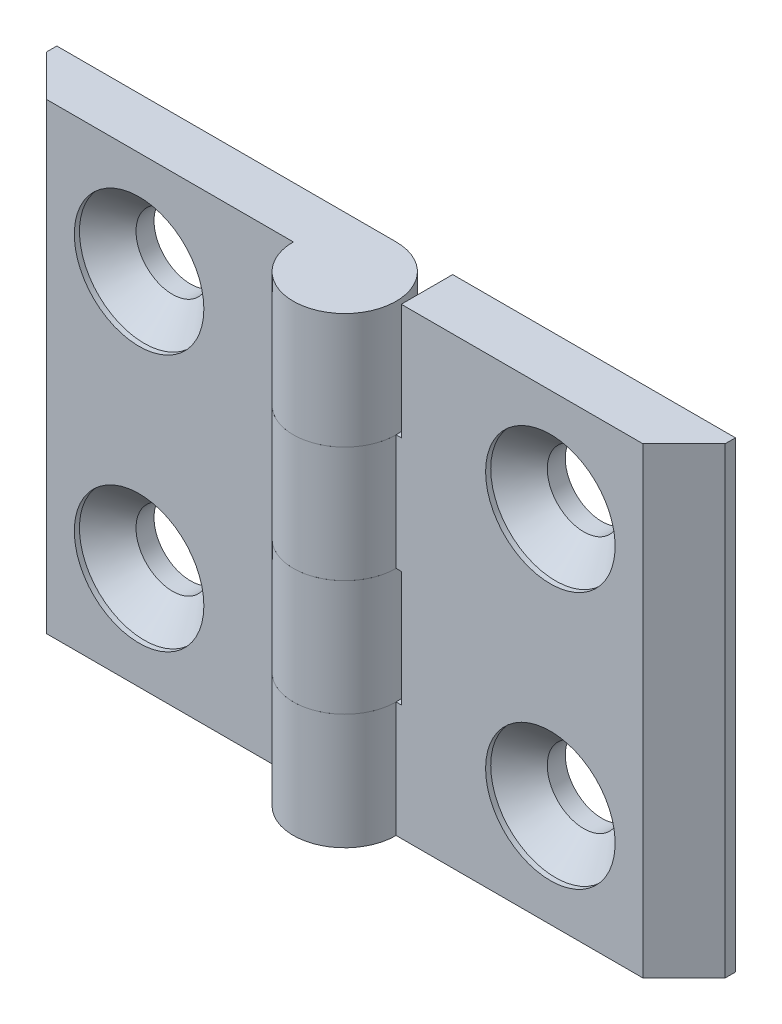
ISO-10303-21;
HEADER;
FILE_DESCRIPTION(('STEP AP214'),'2;1');
FILE_NAME('part.step','',(''),(''),'','','');
FILE_SCHEMA(('AUTOMOTIVE_DESIGN { 1 0 10303 214 1 1 1 1 }'));
ENDSEC;
DATA;
#1=APPLICATION_CONTEXT('core data for automotive mechanical design processes');
#2=APPLICATION_PROTOCOL_DEFINITION('international standard','automotive_design',2000,#1);
#3=PRODUCT_CONTEXT('',#1,'mechanical');
#4=PRODUCT('Part','Part','',(#3));
#5=PRODUCT_RELATED_PRODUCT_CATEGORY('part','',(#4));
#6=PRODUCT_DEFINITION_FORMATION('','',#4);
#7=PRODUCT_DEFINITION_CONTEXT('part definition',#1,'design');
#8=PRODUCT_DEFINITION('design','',#6,#7);
#9=PRODUCT_DEFINITION_SHAPE('','',#8);
#10=(LENGTH_UNIT() NAMED_UNIT(*) SI_UNIT(.MILLI.,.METRE.));
#11=(NAMED_UNIT(*) PLANE_ANGLE_UNIT() SI_UNIT($,.RADIAN.));
#12=(NAMED_UNIT(*) SI_UNIT($,.STERADIAN.) SOLID_ANGLE_UNIT());
#13=UNCERTAINTY_MEASURE_WITH_UNIT(LENGTH_MEASURE(1.E-05),#10,'distance_accuracy_value','');
#14=(GEOMETRIC_REPRESENTATION_CONTEXT(3) GLOBAL_UNCERTAINTY_ASSIGNED_CONTEXT((#13)) GLOBAL_UNIT_ASSIGNED_CONTEXT((#10,
#11,#12)) REPRESENTATION_CONTEXT('',''));
#15=CARTESIAN_POINT('',(0.,0.,0.));
#16=DIRECTION('',(0.,0.,1.));
#17=DIRECTION('',(1.,0.,0.));
#18=AXIS2_PLACEMENT_3D('',#15,#16,#17);
#19=CARTESIAN_POINT('',(0.,-22.5,0.));
#20=DIRECTION('',(0.,1.,0.));
#21=DIRECTION('',(0.,0.,-1.));
#22=AXIS2_PLACEMENT_3D('',#19,#20,#21);
#23=CYLINDRICAL_SURFACE('',#22,5.);
#24=DIRECTION('',(0.,1.,0.));
#25=VECTOR('',#24,1.);
#26=CARTESIAN_POINT('',(5.,-22.5,0.));
#27=LINE('',#26,#25);
#28=CARTESIAN_POINT('',(5.,-22.5,0.));
#29=VERTEX_POINT('',#28);
#30=CARTESIAN_POINT('',(5.,-11.25,0.));
#31=VERTEX_POINT('',#30);
#32=EDGE_CURVE('E194',#29,#31,#27,.T.);
#33=ORIENTED_EDGE('',*,*,#32,.T.);
#34=CARTESIAN_POINT('',(0.,-11.25,0.));
#35=DIRECTION('',(0.,-1.,0.));
#36=DIRECTION('',(0.,0.,1.));
#37=AXIS2_PLACEMENT_3D('',#34,#35,#36);
#38=CIRCLE('',#37,5.);
#39=CARTESIAN_POINT('',(0.,-11.25,-5.));
#40=VERTEX_POINT('',#39);
#41=EDGE_CURVE('E171',#31,#40,#38,.T.);
#42=ORIENTED_EDGE('',*,*,#41,.T.);
#43=DIRECTION('',(0.,1.,0.));
#44=VECTOR('',#43,1.);
#45=CARTESIAN_POINT('',(0.,-22.5,-5.));
#46=LINE('',#45,#44);
#47=CARTESIAN_POINT('',(0.,-22.5,-5.));
#48=VERTEX_POINT('',#47);
#49=EDGE_CURVE('E207',#48,#40,#46,.T.);
#50=ORIENTED_EDGE('',*,*,#49,.F.);
#51=CARTESIAN_POINT('',(0.,-22.5,0.));
#52=DIRECTION('',(0.,-1.,0.));
#53=DIRECTION('',(0.,0.,1.));
#54=AXIS2_PLACEMENT_3D('',#51,#52,#53);
#55=CIRCLE('',#54,5.);
#56=EDGE_CURVE('E174',#29,#48,#55,.T.);
#57=ORIENTED_EDGE('',*,*,#56,.F.);
#58=EDGE_LOOP('',(#33,#42,#50,#57));
#59=FACE_BOUND('',#58,.T.);
#60=ADVANCED_FACE('F45',(#59),#23,.T.);
#61=CARTESIAN_POINT('',(0.,0.,-5.));
#62=VERTEX_POINT('',#61);
#63=CARTESIAN_POINT('',(0.,11.25,-5.));
#64=VERTEX_POINT('',#63);
#65=EDGE_CURVE('E206',#62,#64,#46,.T.);
#66=ORIENTED_EDGE('',*,*,#65,.F.);
#67=CARTESIAN_POINT('',(0.,0.,0.));
#68=DIRECTION('',(0.,1.,0.));
#69=DIRECTION('',(0.,0.,-1.));
#70=AXIS2_PLACEMENT_3D('',#67,#68,#69);
#71=CIRCLE('',#70,5.);
#72=CARTESIAN_POINT('',(5.,0.,0.));
#73=VERTEX_POINT('',#72);
#74=EDGE_CURVE('E142',#62,#73,#71,.T.);
#75=ORIENTED_EDGE('',*,*,#74,.T.);
#76=CARTESIAN_POINT('',(5.,11.25,0.));
#77=VERTEX_POINT('',#76);
#78=EDGE_CURVE('E186',#73,#77,#27,.T.);
#79=ORIENTED_EDGE('',*,*,#78,.T.);
#80=CARTESIAN_POINT('',(0.,11.25,0.));
#81=DIRECTION('',(0.,-1.,0.));
#82=DIRECTION('',(1.,0.,0.));
#83=AXIS2_PLACEMENT_3D('',#80,#81,#82);
#84=CIRCLE('',#83,5.);
#85=EDGE_CURVE('E168',#77,#64,#84,.T.);
#86=ORIENTED_EDGE('',*,*,#85,.T.);
#87=EDGE_LOOP('',(#66,#75,#79,#86));
#88=FACE_BOUND('',#87,.T.);
#89=ADVANCED_FACE('F47',(#88),#23,.T.);
#90=CARTESIAN_POINT('',(0.,-22.5,-5.));
#91=DIRECTION('',(0.,0.,1.));
#92=DIRECTION('',(-1.,0.,0.));
#93=AXIS2_PLACEMENT_3D('',#90,#91,#92);
#94=PLANE('',#93);
#95=CARTESIAN_POINT('',(20.,-12.5,-5.00000000000015));
#96=DIRECTION('',(0.,0.,1.));
#97=DIRECTION('',(-1.,0.,0.));
#98=AXIS2_PLACEMENT_3D('',#95,#96,#97);
#99=CIRCLE('',#98,3.55);
#100=CARTESIAN_POINT('',(16.45,-12.5,-5.00000000000012));
#101=VERTEX_POINT('',#100);
#102=EDGE_CURVE('E377',#101,#101,#99,.T.);
#103=ORIENTED_EDGE('',*,*,#102,.T.);
#104=EDGE_LOOP('',(#103));
#105=FACE_BOUND('',#104,.T.);
#106=CARTESIAN_POINT('',(20.,12.5,-5.00000000000015));
#107=DIRECTION('',(0.,0.,1.));
#108=DIRECTION('',(-1.,0.,0.));
#109=AXIS2_PLACEMENT_3D('',#106,#107,#108);
#110=CIRCLE('',#109,3.55);
#111=CARTESIAN_POINT('',(16.45,12.5,-5.00000000000012));
#112=VERTEX_POINT('',#111);
#113=EDGE_CURVE('E155',#112,#112,#110,.T.);
#114=ORIENTED_EDGE('',*,*,#113,.T.);
#115=EDGE_LOOP('',(#114));
#116=FACE_BOUND('',#115,.T.);
#117=ORIENTED_EDGE('',*,*,#49,.T.);
#118=DIRECTION('',(1.,0.,0.));
#119=VECTOR('',#118,1.);
#120=CARTESIAN_POINT('',(5.49999999999996,-11.25,-5.00000000000004));
#121=LINE('',#120,#119);
#122=CARTESIAN_POINT('',(5.49999999999996,-11.25,-5.00000000000004));
#123=VERTEX_POINT('',#122);
#124=EDGE_CURVE('E137',#40,#123,#121,.T.);
#125=ORIENTED_EDGE('',*,*,#124,.T.);
#126=DIRECTION('',(0.,1.,0.));
#127=VECTOR('',#126,1.);
#128=CARTESIAN_POINT('',(5.49999999999996,-11.25,-5.00000000000004));
#129=LINE('',#128,#127);
#130=CARTESIAN_POINT('',(5.49999999999996,0.,-5.00000000000004));
#131=VERTEX_POINT('',#130);
#132=EDGE_CURVE('E132',#123,#131,#129,.T.);
#133=ORIENTED_EDGE('',*,*,#132,.T.);
#134=DIRECTION('',(-1.,0.,0.));
#135=VECTOR('',#134,1.);
#136=CARTESIAN_POINT('',(5.49999999999996,0.,-5.00000000000004));
#137=LINE('',#136,#135);
#138=EDGE_CURVE('E140',#131,#62,#137,.T.);
#139=ORIENTED_EDGE('',*,*,#138,.T.);
#140=ORIENTED_EDGE('',*,*,#65,.T.);
#141=DIRECTION('',(1.,0.,0.));
#142=VECTOR('',#141,1.);
#143=CARTESIAN_POINT('',(-5.00000000000004,11.25,-4.99999999999996));
#144=LINE('',#143,#142);
#145=CARTESIAN_POINT('',(5.49999999999996,11.25,-5.00000000000004));
#146=VERTEX_POINT('',#145);
#147=EDGE_CURVE('E160',#64,#146,#144,.T.);
#148=ORIENTED_EDGE('',*,*,#147,.T.);
#149=DIRECTION('',(0.,1.,0.));
#150=VECTOR('',#149,1.);
#151=CARTESIAN_POINT('',(5.49999999999996,22.5,-5.00000000000004));
#152=LINE('',#151,#150);
#153=CARTESIAN_POINT('',(5.49999999999996,22.5,-5.00000000000004));
#154=VERTEX_POINT('',#153);
#155=EDGE_CURVE('E163',#146,#154,#152,.T.);
#156=ORIENTED_EDGE('',*,*,#155,.T.);
#157=DIRECTION('',(1.,0.,0.));
#158=VECTOR('',#157,1.);
#159=CARTESIAN_POINT('',(0.,22.5,-5.));
#160=LINE('',#159,#158);
#161=CARTESIAN_POINT('',(33.,22.5,-5.00000000000024));
#162=VERTEX_POINT('',#161);
#163=EDGE_CURVE('E173',#154,#162,#160,.T.);
#164=ORIENTED_EDGE('',*,*,#163,.T.);
#165=DIRECTION('',(0.,1.,0.));
#166=VECTOR('',#165,1.);
#167=CARTESIAN_POINT('',(33.,-22.5,-5.00000000000024));
#168=LINE('',#167,#166);
#169=CARTESIAN_POINT('',(33.,-22.5,-5.00000000000024));
#170=VERTEX_POINT('',#169);
#171=EDGE_CURVE('E203',#170,#162,#168,.T.);
#172=ORIENTED_EDGE('',*,*,#171,.F.);
#173=DIRECTION('',(1.,0.,0.));
#174=VECTOR('',#173,1.);
#175=CARTESIAN_POINT('',(0.,-22.5,-5.));
#176=LINE('',#175,#174);
#177=EDGE_CURVE('E177',#48,#170,#176,.T.);
#178=ORIENTED_EDGE('',*,*,#177,.F.);
#179=EDGE_LOOP('',(#117,#125,#133,#139,#140,#148,#156,#164,#172,#178));
#180=FACE_BOUND('',#179,.T.);
#181=ADVANCED_FACE('F148',(#105,#116,#180),#94,.F.);
#182=CARTESIAN_POINT('',(33.,-22.5,-5.00000000000024));
#183=DIRECTION('',(-1.,0.,0.));
#184=DIRECTION('',(0.,0.,-1.));
#185=AXIS2_PLACEMENT_3D('',#182,#183,#184);
#186=PLANE('',#185);
#187=DIRECTION('',(0.,0.,1.));
#188=VECTOR('',#187,1.);
#189=CARTESIAN_POINT('',(33.,22.5,-5.00000000000024));
#190=LINE('',#189,#188);
#191=CARTESIAN_POINT('',(33.,22.5,-4.00000000000024));
#192=VERTEX_POINT('',#191);
#193=EDGE_CURVE('E188',#162,#192,#190,.T.);
#194=ORIENTED_EDGE('',*,*,#193,.T.);
#195=DIRECTION('',(0.,1.,0.));
#196=VECTOR('',#195,1.);
#197=CARTESIAN_POINT('',(33.,-22.5,-4.00000000000024));
#198=LINE('',#197,#196);
#199=CARTESIAN_POINT('',(33.,-22.5,-4.00000000000024));
#200=VERTEX_POINT('',#199);
#201=EDGE_CURVE('E200',#200,#192,#198,.T.);
#202=ORIENTED_EDGE('',*,*,#201,.F.);
#203=DIRECTION('',(0.,0.,1.));
#204=VECTOR('',#203,1.);
#205=CARTESIAN_POINT('',(33.,-22.5,-5.00000000000024));
#206=LINE('',#205,#204);
#207=EDGE_CURVE('E180',#170,#200,#206,.T.);
#208=ORIENTED_EDGE('',*,*,#207,.F.);
#209=ORIENTED_EDGE('',*,*,#171,.T.);
#210=EDGE_LOOP('',(#194,#202,#208,#209));
#211=FACE_BOUND('',#210,.T.);
#212=ADVANCED_FACE('F237',(#211),#186,.F.);
#213=CARTESIAN_POINT('',(33.,-22.5,-4.00000000000024));
#214=DIRECTION('',(-0.707106781186549,0.,-0.707106781186546));
#215=DIRECTION('',(0.707106781186546,0.,-0.707106781186549));
#216=AXIS2_PLACEMENT_3D('',#213,#214,#215);
#217=PLANE('',#216);
#218=DIRECTION('',(-0.707106781186546,0.,0.707106781186549));
#219=VECTOR('',#218,1.);
#220=CARTESIAN_POINT('',(33.,22.5,-4.00000000000024));
#221=LINE('',#220,#219);
#222=CARTESIAN_POINT('',(29.,22.5,-2.16711820523011E-13));
#223=VERTEX_POINT('',#222);
#224=EDGE_CURVE('E190',#192,#223,#221,.T.);
#225=ORIENTED_EDGE('',*,*,#224,.T.);
#226=DIRECTION('',(0.,1.,0.));
#227=VECTOR('',#226,1.);
#228=CARTESIAN_POINT('',(29.,-22.5,-2.16711820523011E-13));
#229=LINE('',#228,#227);
#230=CARTESIAN_POINT('',(29.,-22.5,-2.16711820523011E-13));
#231=VERTEX_POINT('',#230);
#232=EDGE_CURVE('E197',#231,#223,#229,.T.);
#233=ORIENTED_EDGE('',*,*,#232,.F.);
#234=DIRECTION('',(-0.707106781186546,0.,0.707106781186549));
#235=VECTOR('',#234,1.);
#236=CARTESIAN_POINT('',(33.,-22.5,-4.00000000000024));
#237=LINE('',#236,#235);
#238=EDGE_CURVE('E182',#200,#231,#237,.T.);
#239=ORIENTED_EDGE('',*,*,#238,.F.);
#240=ORIENTED_EDGE('',*,*,#201,.T.);
#241=EDGE_LOOP('',(#225,#233,#239,#240));
#242=FACE_BOUND('',#241,.T.);
#243=ADVANCED_FACE('F234',(#242),#217,.F.);
#244=CARTESIAN_POINT('',(29.,-22.5,-2.16711820523011E-13));
#245=DIRECTION('',(0.,0.,-1.));
#246=DIRECTION('',(1.,0.,0.));
#247=AXIS2_PLACEMENT_3D('',#244,#245,#246);
#248=PLANE('',#247);
#249=CARTESIAN_POINT('',(20.,-12.5,-1.49673268381401E-13));
#250=DIRECTION('',(0.,0.,1.));
#251=DIRECTION('',(-1.,0.,0.));
#252=AXIS2_PLACEMENT_3D('',#249,#250,#251);
#253=CIRCLE('',#252,6.3);
#254=CARTESIAN_POINT('',(13.7,-12.5,-1.02594493578126E-13));
#255=VERTEX_POINT('',#254);
#256=EDGE_CURVE('E370',#255,#255,#253,.T.);
#257=ORIENTED_EDGE('',*,*,#256,.F.);
#258=EDGE_LOOP('',(#257));
#259=FACE_BOUND('',#258,.T.);
#260=CARTESIAN_POINT('',(20.,12.5,-1.49673268381401E-13));
#261=DIRECTION('',(0.,0.,1.));
#262=DIRECTION('',(-1.,0.,0.));
#263=AXIS2_PLACEMENT_3D('',#260,#261,#262);
#264=CIRCLE('',#263,6.3);
#265=CARTESIAN_POINT('',(13.7,12.5,-1.02594493578126E-13));
#266=VERTEX_POINT('',#265);
#267=EDGE_CURVE('E379',#266,#266,#264,.T.);
#268=ORIENTED_EDGE('',*,*,#267,.F.);
#269=EDGE_LOOP('',(#268));
#270=FACE_BOUND('',#269,.T.);
#271=DIRECTION('',(0.,-1.,0.));
#272=VECTOR('',#271,1.);
#273=CARTESIAN_POINT('',(5.5,-22.5,0.));
#274=LINE('',#273,#272);
#275=CARTESIAN_POINT('',(5.5,0.,0.));
#276=VERTEX_POINT('',#275);
#277=CARTESIAN_POINT('',(5.5,-11.25,0.));
#278=VERTEX_POINT('',#277);
#279=EDGE_CURVE('E53',#276,#278,#274,.T.);
#280=ORIENTED_EDGE('',*,*,#279,.T.);
#281=DIRECTION('',(-1.,0.,0.));
#282=VECTOR('',#281,1.);
#283=CARTESIAN_POINT('',(29.,-11.25,-2.16711820523011E-13));
#284=LINE('',#283,#282);
#285=EDGE_CURVE('E12',#278,#31,#284,.T.);
#286=ORIENTED_EDGE('',*,*,#285,.T.);
#287=ORIENTED_EDGE('',*,*,#32,.F.);
#288=DIRECTION('',(-1.,0.,0.));
#289=VECTOR('',#288,1.);
#290=CARTESIAN_POINT('',(29.,-22.5,-2.16711820523011E-13));
#291=LINE('',#290,#289);
#292=EDGE_CURVE('E184',#231,#29,#291,.T.);
#293=ORIENTED_EDGE('',*,*,#292,.F.);
#294=ORIENTED_EDGE('',*,*,#232,.T.);
#295=DIRECTION('',(-1.,0.,0.));
#296=VECTOR('',#295,1.);
#297=CARTESIAN_POINT('',(29.,22.5,-2.16711820523011E-13));
#298=LINE('',#297,#296);
#299=CARTESIAN_POINT('',(5.5,22.5,0.));
#300=VERTEX_POINT('',#299);
#301=EDGE_CURVE('E178',#223,#300,#298,.T.);
#302=ORIENTED_EDGE('',*,*,#301,.T.);
#303=DIRECTION('',(0.,-1.,0.));
#304=VECTOR('',#303,1.);
#305=CARTESIAN_POINT('',(5.49999999999998,-22.5,0.));
#306=LINE('',#305,#304);
#307=CARTESIAN_POINT('',(5.5,11.25,0.));
#308=VERTEX_POINT('',#307);
#309=EDGE_CURVE('E68',#300,#308,#306,.T.);
#310=ORIENTED_EDGE('',*,*,#309,.T.);
#311=DIRECTION('',(-1.,0.,0.));
#312=VECTOR('',#311,1.);
#313=CARTESIAN_POINT('',(29.,11.25,-2.16711820523011E-13));
#314=LINE('',#313,#312);
#315=EDGE_CURVE('E209',#308,#77,#314,.T.);
#316=ORIENTED_EDGE('',*,*,#315,.T.);
#317=ORIENTED_EDGE('',*,*,#78,.F.);
#318=DIRECTION('',(1.,0.,0.));
#319=VECTOR('',#318,1.);
#320=CARTESIAN_POINT('',(29.,0.,-2.16711820523011E-13));
#321=LINE('',#320,#319);
#322=EDGE_CURVE('E212',#73,#276,#321,.T.);
#323=ORIENTED_EDGE('',*,*,#322,.T.);
#324=EDGE_LOOP('',(#280,#286,#287,#293,#294,#302,#310,#316,#317,#323));
#325=FACE_BOUND('',#324,.T.);
#326=ADVANCED_FACE('F214',(#259,#270,#325),#248,.F.);
#327=CARTESIAN_POINT('',(0.,-22.5,0.));
#328=DIRECTION('',(0.,-1.,0.));
#329=DIRECTION('',(0.,0.,1.));
#330=AXIS2_PLACEMENT_3D('',#327,#328,#329);
#331=PLANE('',#330);
#332=ORIENTED_EDGE('',*,*,#56,.T.);
#333=ORIENTED_EDGE('',*,*,#177,.T.);
#334=ORIENTED_EDGE('',*,*,#207,.T.);
#335=ORIENTED_EDGE('',*,*,#238,.T.);
#336=ORIENTED_EDGE('',*,*,#292,.T.);
#337=EDGE_LOOP('',(#332,#333,#334,#335,#336));
#338=FACE_BOUND('',#337,.T.);
#339=ADVANCED_FACE('F243',(#338),#331,.T.);
#340=CARTESIAN_POINT('',(0.,22.5,0.));
#341=DIRECTION('',(0.,-1.,0.));
#342=DIRECTION('',(0.,0.,1.));
#343=AXIS2_PLACEMENT_3D('',#340,#341,#342);
#344=PLANE('',#343);
#345=ORIENTED_EDGE('',*,*,#163,.F.);
#346=DIRECTION('',(0.,0.,1.));
#347=VECTOR('',#346,1.);
#348=CARTESIAN_POINT('',(5.49999999999996,22.5,-5.00000000000004));
#349=LINE('',#348,#347);
#350=EDGE_CURVE('E150',#154,#300,#349,.T.);
#351=ORIENTED_EDGE('',*,*,#350,.T.);
#352=ORIENTED_EDGE('',*,*,#301,.F.);
#353=ORIENTED_EDGE('',*,*,#224,.F.);
#354=ORIENTED_EDGE('',*,*,#193,.F.);
#355=EDGE_LOOP('',(#345,#351,#352,#353,#354));
#356=FACE_BOUND('',#355,.T.);
#357=ADVANCED_FACE('F227',(#356),#344,.F.);
#358=CARTESIAN_POINT('',(-5.00000000000004,11.25,-4.99999999999996));
#359=DIRECTION('',(0.,-1.,0.));
#360=DIRECTION('',(1.,0.,0.));
#361=AXIS2_PLACEMENT_3D('',#358,#359,#360);
#362=PLANE('',#361);
#363=ORIENTED_EDGE('',*,*,#85,.F.);
#364=ORIENTED_EDGE('',*,*,#315,.F.);
#365=DIRECTION('',(0.,0.,1.));
#366=VECTOR('',#365,1.);
#367=CARTESIAN_POINT('',(5.49999999999996,11.25,-5.00000000000004));
#368=LINE('',#367,#366);
#369=EDGE_CURVE('E152',#146,#308,#368,.T.);
#370=ORIENTED_EDGE('',*,*,#369,.F.);
#371=ORIENTED_EDGE('',*,*,#147,.F.);
#372=EDGE_LOOP('',(#363,#364,#370,#371));
#373=FACE_BOUND('',#372,.T.);
#374=ADVANCED_FACE('F223',(#373),#362,.F.);
#375=CARTESIAN_POINT('',(5.49999999999996,22.5,-5.00000000000004));
#376=DIRECTION('',(1.,0.,0.));
#377=DIRECTION('',(0.,1.,0.));
#378=AXIS2_PLACEMENT_3D('',#375,#376,#377);
#379=PLANE('',#378);
#380=ORIENTED_EDGE('',*,*,#350,.F.);
#381=ORIENTED_EDGE('',*,*,#155,.F.);
#382=ORIENTED_EDGE('',*,*,#369,.T.);
#383=ORIENTED_EDGE('',*,*,#309,.F.);
#384=EDGE_LOOP('',(#380,#381,#382,#383));
#385=FACE_BOUND('',#384,.T.);
#386=ADVANCED_FACE('F224',(#385),#379,.F.);
#387=CARTESIAN_POINT('',(5.49999999999996,-11.25,-5.00000000000004));
#388=DIRECTION('',(1.,0.,0.));
#389=DIRECTION('',(0.,1.,0.));
#390=AXIS2_PLACEMENT_3D('',#387,#388,#389);
#391=PLANE('',#390);
#392=DIRECTION('',(0.,0.,1.));
#393=VECTOR('',#392,1.);
#394=CARTESIAN_POINT('',(5.49999999999996,0.,-5.00000000000004));
#395=LINE('',#394,#393);
#396=EDGE_CURVE('E60',#131,#276,#395,.T.);
#397=ORIENTED_EDGE('',*,*,#396,.F.);
#398=ORIENTED_EDGE('',*,*,#132,.F.);
#399=DIRECTION('',(0.,0.,1.));
#400=VECTOR('',#399,1.);
#401=CARTESIAN_POINT('',(5.49999999999996,-11.25,-5.00000000000004));
#402=LINE('',#401,#400);
#403=EDGE_CURVE('E136',#123,#278,#402,.T.);
#404=ORIENTED_EDGE('',*,*,#403,.T.);
#405=ORIENTED_EDGE('',*,*,#279,.F.);
#406=EDGE_LOOP('',(#397,#398,#404,#405));
#407=FACE_BOUND('',#406,.T.);
#408=ADVANCED_FACE('F129',(#407),#391,.F.);
#409=CARTESIAN_POINT('',(5.49999999999996,-11.25,-5.00000000000004));
#410=DIRECTION('',(0.,-1.,0.));
#411=DIRECTION('',(0.,0.,1.));
#412=AXIS2_PLACEMENT_3D('',#409,#410,#411);
#413=PLANE('',#412);
#414=ORIENTED_EDGE('',*,*,#41,.F.);
#415=ORIENTED_EDGE('',*,*,#285,.F.);
#416=ORIENTED_EDGE('',*,*,#403,.F.);
#417=ORIENTED_EDGE('',*,*,#124,.F.);
#418=EDGE_LOOP('',(#414,#415,#416,#417));
#419=FACE_BOUND('',#418,.T.);
#420=ADVANCED_FACE('F246',(#419),#413,.F.);
#421=CARTESIAN_POINT('',(5.49999999999996,0.,-5.00000000000004));
#422=DIRECTION('',(0.,1.,0.));
#423=DIRECTION('',(0.,0.,-1.));
#424=AXIS2_PLACEMENT_3D('',#421,#422,#423);
#425=PLANE('',#424);
#426=ORIENTED_EDGE('',*,*,#138,.F.);
#427=ORIENTED_EDGE('',*,*,#396,.T.);
#428=ORIENTED_EDGE('',*,*,#322,.F.);
#429=ORIENTED_EDGE('',*,*,#74,.F.);
#430=EDGE_LOOP('',(#426,#427,#428,#429));
#431=FACE_BOUND('',#430,.T.);
#432=ADVANCED_FACE('F141',(#431),#425,.F.);
#433=CARTESIAN_POINT('',(20.,12.5,-1.49456427946904E-13));
#434=DIRECTION('',(0.,0.,1.));
#435=DIRECTION('',(-1.,0.,0.));
#436=AXIS2_PLACEMENT_3D('',#433,#434,#435);
#437=CYLINDRICAL_SURFACE('',#436,3.55);
#438=ORIENTED_EDGE('',*,*,#113,.F.);
#439=EDGE_LOOP('',(#438));
#440=FACE_BOUND('',#439,.T.);
#441=CARTESIAN_POINT('',(20.,12.5,-3.25000000000015));
#442=DIRECTION('',(0.,0.,1.));
#443=DIRECTION('',(-1.,0.,0.));
#444=AXIS2_PLACEMENT_3D('',#441,#442,#443);
#445=CIRCLE('',#444,3.55);
#446=CARTESIAN_POINT('',(16.45,12.5,-3.25000000000012));
#447=VERTEX_POINT('',#446);
#448=EDGE_CURVE('E384',#447,#447,#445,.T.);
#449=ORIENTED_EDGE('',*,*,#448,.T.);
#450=EDGE_LOOP('',(#449));
#451=FACE_BOUND('',#450,.T.);
#452=ADVANCED_FACE('F253',(#440,#451),#437,.F.);
#453=CARTESIAN_POINT('',(20.,12.5,-0.50000000000015));
#454=DIRECTION('',(0.,0.,1.));
#455=DIRECTION('',(-1.,0.,0.));
#456=AXIS2_PLACEMENT_3D('',#453,#454,#455);
#457=CONICAL_SURFACE('',#456,6.3,0.785398163397449);
#458=ORIENTED_EDGE('',*,*,#448,.F.);
#459=EDGE_LOOP('',(#458));
#460=FACE_BOUND('',#459,.T.);
#461=CARTESIAN_POINT('',(20.,12.5,-0.50000000000015));
#462=DIRECTION('',(0.,0.,1.));
#463=DIRECTION('',(-1.,0.,0.));
#464=AXIS2_PLACEMENT_3D('',#461,#462,#463);
#465=CIRCLE('',#464,6.3);
#466=CARTESIAN_POINT('',(13.7,12.5,-0.500000000000103));
#467=VERTEX_POINT('',#466);
#468=EDGE_CURVE('E382',#467,#467,#465,.T.);
#469=ORIENTED_EDGE('',*,*,#468,.T.);
#470=EDGE_LOOP('',(#469));
#471=FACE_BOUND('',#470,.T.);
#472=ADVANCED_FACE('F311',(#460,#471),#457,.F.);
#473=CARTESIAN_POINT('',(20.,12.5,-1.49456427946904E-13));
#474=DIRECTION('',(0.,0.,1.));
#475=DIRECTION('',(-1.,0.,0.));
#476=AXIS2_PLACEMENT_3D('',#473,#474,#475);
#477=CYLINDRICAL_SURFACE('',#476,6.3);
#478=ORIENTED_EDGE('',*,*,#468,.F.);
#479=EDGE_LOOP('',(#478));
#480=FACE_BOUND('',#479,.T.);
#481=ORIENTED_EDGE('',*,*,#267,.T.);
#482=EDGE_LOOP('',(#481));
#483=FACE_BOUND('',#482,.T.);
#484=ADVANCED_FACE('F320',(#480,#483),#477,.F.);
#485=CARTESIAN_POINT('',(20.,-12.5,-1.49456427946904E-13));
#486=DIRECTION('',(0.,0.,1.));
#487=DIRECTION('',(-1.,0.,0.));
#488=AXIS2_PLACEMENT_3D('',#485,#486,#487);
#489=CYLINDRICAL_SURFACE('',#488,3.55);
#490=ORIENTED_EDGE('',*,*,#102,.F.);
#491=EDGE_LOOP('',(#490));
#492=FACE_BOUND('',#491,.T.);
#493=CARTESIAN_POINT('',(20.,-12.5,-3.25000000000015));
#494=DIRECTION('',(0.,0.,1.));
#495=DIRECTION('',(-1.,0.,0.));
#496=AXIS2_PLACEMENT_3D('',#493,#494,#495);
#497=CIRCLE('',#496,3.55);
#498=CARTESIAN_POINT('',(16.45,-12.5,-3.25000000000012));
#499=VERTEX_POINT('',#498);
#500=EDGE_CURVE('E372',#499,#499,#497,.T.);
#501=ORIENTED_EDGE('',*,*,#500,.T.);
#502=EDGE_LOOP('',(#501));
#503=FACE_BOUND('',#502,.T.);
#504=ADVANCED_FACE('F330',(#492,#503),#489,.F.);
#505=CARTESIAN_POINT('',(20.,-12.5,-0.50000000000015));
#506=DIRECTION('',(0.,0.,1.));
#507=DIRECTION('',(-1.,0.,0.));
#508=AXIS2_PLACEMENT_3D('',#505,#506,#507);
#509=CONICAL_SURFACE('',#508,6.3,0.785398163397449);
#510=ORIENTED_EDGE('',*,*,#500,.F.);
#511=EDGE_LOOP('',(#510));
#512=FACE_BOUND('',#511,.T.);
#513=CARTESIAN_POINT('',(20.,-12.5,-0.50000000000015));
#514=DIRECTION('',(0.,0.,1.));
#515=DIRECTION('',(-1.,0.,0.));
#516=AXIS2_PLACEMENT_3D('',#513,#514,#515);
#517=CIRCLE('',#516,6.3);
#518=CARTESIAN_POINT('',(13.7,-12.5,-0.500000000000103));
#519=VERTEX_POINT('',#518);
#520=EDGE_CURVE('E367',#519,#519,#517,.T.);
#521=ORIENTED_EDGE('',*,*,#520,.T.);
#522=EDGE_LOOP('',(#521));
#523=FACE_BOUND('',#522,.T.);
#524=ADVANCED_FACE('F340',(#512,#523),#509,.F.);
#525=CARTESIAN_POINT('',(20.,-12.5,-1.49456427946904E-13));
#526=DIRECTION('',(0.,0.,1.));
#527=DIRECTION('',(-1.,0.,0.));
#528=AXIS2_PLACEMENT_3D('',#525,#526,#527);
#529=CYLINDRICAL_SURFACE('',#528,6.3);
#530=ORIENTED_EDGE('',*,*,#520,.F.);
#531=EDGE_LOOP('',(#530));
#532=FACE_BOUND('',#531,.T.);
#533=ORIENTED_EDGE('',*,*,#256,.T.);
#534=EDGE_LOOP('',(#533));
#535=FACE_BOUND('',#534,.T.);
#536=ADVANCED_FACE('F350',(#532,#535),#529,.F.);
#537=CLOSED_SHELL('',(#60,#89,#181,#212,#243,#326,#339,#357,#374,#386,#408,#420,#432,#452,#472,
#484,#504,#524,#536));
#538=MANIFOLD_SOLID_BREP('B2',#537);
#539=CARTESIAN_POINT('',(0.,22.5,0.));
#540=DIRECTION('',(0.,-1.,0.));
#541=DIRECTION('',(0.,0.,-1.));
#542=AXIS2_PLACEMENT_3D('',#539,#540,#541);
#543=CYLINDRICAL_SURFACE('',#542,5.);
#544=DIRECTION('',(0.,-1.,0.));
#545=VECTOR('',#544,1.);
#546=CARTESIAN_POINT('',(-5.,22.5,0.));
#547=LINE('',#546,#545);
#548=CARTESIAN_POINT('',(-5.,22.5,0.));
#549=VERTEX_POINT('',#548);
#550=CARTESIAN_POINT('',(-5.,11.25,0.));
#551=VERTEX_POINT('',#550);
#552=EDGE_CURVE('E599',#549,#551,#547,.T.);
#553=ORIENTED_EDGE('',*,*,#552,.T.);
#554=CARTESIAN_POINT('',(0.,11.25,0.));
#555=DIRECTION('',(0.,1.,0.));
#556=DIRECTION('',(0.,0.,1.));
#557=AXIS2_PLACEMENT_3D('',#554,#555,#556);
#558=CIRCLE('',#557,5.);
#559=CARTESIAN_POINT('',(0.,11.25,-5.));
#560=VERTEX_POINT('',#559);
#561=EDGE_CURVE('E576',#551,#560,#558,.T.);
#562=ORIENTED_EDGE('',*,*,#561,.T.);
#563=DIRECTION('',(0.,-1.,0.));
#564=VECTOR('',#563,1.);
#565=CARTESIAN_POINT('',(0.,22.5,-5.));
#566=LINE('',#565,#564);
#567=CARTESIAN_POINT('',(0.,22.5,-5.));
#568=VERTEX_POINT('',#567);
#569=EDGE_CURVE('E612',#568,#560,#566,.T.);
#570=ORIENTED_EDGE('',*,*,#569,.F.);
#571=CARTESIAN_POINT('',(0.,22.5,0.));
#572=DIRECTION('',(0.,1.,0.));
#573=DIRECTION('',(0.,0.,1.));
#574=AXIS2_PLACEMENT_3D('',#571,#572,#573);
#575=CIRCLE('',#574,5.);
#576=EDGE_CURVE('E579',#549,#568,#575,.T.);
#577=ORIENTED_EDGE('',*,*,#576,.F.);
#578=EDGE_LOOP('',(#553,#562,#570,#577));
#579=FACE_BOUND('',#578,.T.);
#580=ADVANCED_FACE('F450',(#579),#543,.T.);
#581=CARTESIAN_POINT('',(0.,0.,-5.));
#582=VERTEX_POINT('',#581);
#583=CARTESIAN_POINT('',(0.,-11.25,-5.));
#584=VERTEX_POINT('',#583);
#585=EDGE_CURVE('E611',#582,#584,#566,.T.);
#586=ORIENTED_EDGE('',*,*,#585,.F.);
#587=CARTESIAN_POINT('',(0.,0.,0.));
#588=DIRECTION('',(0.,-1.,0.));
#589=DIRECTION('',(0.,0.,-1.));
#590=AXIS2_PLACEMENT_3D('',#587,#588,#589);
#591=CIRCLE('',#590,5.);
#592=CARTESIAN_POINT('',(-5.,0.,0.));
#593=VERTEX_POINT('',#592);
#594=EDGE_CURVE('E547',#582,#593,#591,.T.);
#595=ORIENTED_EDGE('',*,*,#594,.T.);
#596=CARTESIAN_POINT('',(-5.,-11.25,0.));
#597=VERTEX_POINT('',#596);
#598=EDGE_CURVE('E591',#593,#597,#547,.T.);
#599=ORIENTED_EDGE('',*,*,#598,.T.);
#600=CARTESIAN_POINT('',(0.,-11.25,0.));
#601=DIRECTION('',(0.,1.,0.));
#602=DIRECTION('',(-1.,0.,0.));
#603=AXIS2_PLACEMENT_3D('',#600,#601,#602);
#604=CIRCLE('',#603,5.);
#605=EDGE_CURVE('E573',#597,#584,#604,.T.);
#606=ORIENTED_EDGE('',*,*,#605,.T.);
#607=EDGE_LOOP('',(#586,#595,#599,#606));
#608=FACE_BOUND('',#607,.T.);
#609=ADVANCED_FACE('F452',(#608),#543,.T.);
#610=CARTESIAN_POINT('',(0.,22.5,-5.));
#611=DIRECTION('',(0.,0.,1.));
#612=DIRECTION('',(1.,0.,0.));
#613=AXIS2_PLACEMENT_3D('',#610,#611,#612);
#614=PLANE('',#613);
#615=CARTESIAN_POINT('',(-20.,12.5,-5.));
#616=DIRECTION('',(0.,0.,1.));
#617=DIRECTION('',(1.,0.,0.));
#618=AXIS2_PLACEMENT_3D('',#615,#616,#617);
#619=CIRCLE('',#618,3.55);
#620=CARTESIAN_POINT('',(-16.45,12.5,-5.));
#621=VERTEX_POINT('',#620);
#622=EDGE_CURVE('E796',#621,#621,#619,.T.);
#623=ORIENTED_EDGE('',*,*,#622,.T.);
#624=EDGE_LOOP('',(#623));
#625=FACE_BOUND('',#624,.T.);
#626=CARTESIAN_POINT('',(-20.,-12.5,-5.));
#627=DIRECTION('',(0.,0.,1.));
#628=DIRECTION('',(1.,0.,0.));
#629=AXIS2_PLACEMENT_3D('',#626,#627,#628);
#630=CIRCLE('',#629,3.55);
#631=CARTESIAN_POINT('',(-16.45,-12.5,-5.));
#632=VERTEX_POINT('',#631);
#633=EDGE_CURVE('E560',#632,#632,#630,.T.);
#634=ORIENTED_EDGE('',*,*,#633,.T.);
#635=EDGE_LOOP('',(#634));
#636=FACE_BOUND('',#635,.T.);
#637=ORIENTED_EDGE('',*,*,#569,.T.);
#638=DIRECTION('',(-1.,0.,0.));
#639=VECTOR('',#638,1.);
#640=CARTESIAN_POINT('',(-5.5,11.25,-5.));
#641=LINE('',#640,#639);
#642=CARTESIAN_POINT('',(-5.5,11.25,-5.));
#643=VERTEX_POINT('',#642);
#644=EDGE_CURVE('E542',#560,#643,#641,.T.);
#645=ORIENTED_EDGE('',*,*,#644,.T.);
#646=DIRECTION('',(0.,-1.,0.));
#647=VECTOR('',#646,1.);
#648=CARTESIAN_POINT('',(-5.5,11.25,-5.));
#649=LINE('',#648,#647);
#650=CARTESIAN_POINT('',(-5.5,0.,-5.));
#651=VERTEX_POINT('',#650);
#652=EDGE_CURVE('E537',#643,#651,#649,.T.);
#653=ORIENTED_EDGE('',*,*,#652,.T.);
#654=DIRECTION('',(1.,0.,0.));
#655=VECTOR('',#654,1.);
#656=CARTESIAN_POINT('',(-5.5,0.,-5.));
#657=LINE('',#656,#655);
#658=EDGE_CURVE('E545',#651,#582,#657,.T.);
#659=ORIENTED_EDGE('',*,*,#658,.T.);
#660=ORIENTED_EDGE('',*,*,#585,.T.);
#661=DIRECTION('',(-1.,0.,0.));
#662=VECTOR('',#661,1.);
#663=CARTESIAN_POINT('',(5.,-11.25,-5.));
#664=LINE('',#663,#662);
#665=CARTESIAN_POINT('',(-5.5,-11.25,-5.));
#666=VERTEX_POINT('',#665);
#667=EDGE_CURVE('E565',#584,#666,#664,.T.);
#668=ORIENTED_EDGE('',*,*,#667,.T.);
#669=DIRECTION('',(0.,-1.,0.));
#670=VECTOR('',#669,1.);
#671=CARTESIAN_POINT('',(-5.5,-22.5,-5.));
#672=LINE('',#671,#670);
#673=CARTESIAN_POINT('',(-5.5,-22.5,-5.));
#674=VERTEX_POINT('',#673);
#675=EDGE_CURVE('E568',#666,#674,#672,.T.);
#676=ORIENTED_EDGE('',*,*,#675,.T.);
#677=DIRECTION('',(-1.,0.,0.));
#678=VECTOR('',#677,1.);
#679=CARTESIAN_POINT('',(0.,-22.5,-5.));
#680=LINE('',#679,#678);
#681=CARTESIAN_POINT('',(-33.,-22.5,-5.));
#682=VERTEX_POINT('',#681);
#683=EDGE_CURVE('E578',#674,#682,#680,.T.);
#684=ORIENTED_EDGE('',*,*,#683,.T.);
#685=DIRECTION('',(0.,-1.,0.));
#686=VECTOR('',#685,1.);
#687=CARTESIAN_POINT('',(-33.,22.5,-5.));
#688=LINE('',#687,#686);
#689=CARTESIAN_POINT('',(-33.,22.5,-5.));
#690=VERTEX_POINT('',#689);
#691=EDGE_CURVE('E608',#690,#682,#688,.T.);
#692=ORIENTED_EDGE('',*,*,#691,.F.);
#693=DIRECTION('',(-1.,0.,0.));
#694=VECTOR('',#693,1.);
#695=CARTESIAN_POINT('',(0.,22.5,-5.));
#696=LINE('',#695,#694);
#697=EDGE_CURVE('E582',#568,#690,#696,.T.);
#698=ORIENTED_EDGE('',*,*,#697,.F.);
#699=EDGE_LOOP('',(#637,#645,#653,#659,#660,#668,#676,#684,#692,#698));
#700=FACE_BOUND('',#699,.T.);
#701=ADVANCED_FACE('F553',(#625,#636,#700),#614,.F.);
#702=CARTESIAN_POINT('',(-33.,22.5,-5.));
#703=DIRECTION('',(1.,0.,0.));
#704=DIRECTION('',(0.,0.,-1.));
#705=AXIS2_PLACEMENT_3D('',#702,#703,#704);
#706=PLANE('',#705);
#707=DIRECTION('',(0.,0.,1.));
#708=VECTOR('',#707,1.);
#709=CARTESIAN_POINT('',(-33.,-22.5,-5.));
#710=LINE('',#709,#708);
#711=CARTESIAN_POINT('',(-33.,-22.5,-4.));
#712=VERTEX_POINT('',#711);
#713=EDGE_CURVE('E593',#682,#712,#710,.T.);
#714=ORIENTED_EDGE('',*,*,#713,.T.);
#715=DIRECTION('',(0.,-1.,0.));
#716=VECTOR('',#715,1.);
#717=CARTESIAN_POINT('',(-33.,22.5,-4.));
#718=LINE('',#717,#716);
#719=CARTESIAN_POINT('',(-33.,22.5,-4.));
#720=VERTEX_POINT('',#719);
#721=EDGE_CURVE('E605',#720,#712,#718,.T.);
#722=ORIENTED_EDGE('',*,*,#721,.F.);
#723=DIRECTION('',(0.,0.,1.));
#724=VECTOR('',#723,1.);
#725=CARTESIAN_POINT('',(-33.,22.5,-5.));
#726=LINE('',#725,#724);
#727=EDGE_CURVE('E585',#690,#720,#726,.T.);
#728=ORIENTED_EDGE('',*,*,#727,.F.);
#729=ORIENTED_EDGE('',*,*,#691,.T.);
#730=EDGE_LOOP('',(#714,#722,#728,#729));
#731=FACE_BOUND('',#730,.T.);
#732=ADVANCED_FACE('F642',(#731),#706,.F.);
#733=CARTESIAN_POINT('',(-33.,22.5,-4.));
#734=DIRECTION('',(0.707106781186544,0.,-0.707106781186551));
#735=DIRECTION('',(-0.707106781186551,0.,-0.707106781186544));
#736=AXIS2_PLACEMENT_3D('',#733,#734,#735);
#737=PLANE('',#736);
#738=DIRECTION('',(0.707106781186551,0.,0.707106781186544));
#739=VECTOR('',#738,1.);
#740=CARTESIAN_POINT('',(-33.,-22.5,-4.));
#741=LINE('',#740,#739);
#742=CARTESIAN_POINT('',(-29.,-22.5,0.));
#743=VERTEX_POINT('',#742);
#744=EDGE_CURVE('E595',#712,#743,#741,.T.);
#745=ORIENTED_EDGE('',*,*,#744,.T.);
#746=DIRECTION('',(0.,-1.,0.));
#747=VECTOR('',#746,1.);
#748=CARTESIAN_POINT('',(-29.,22.5,0.));
#749=LINE('',#748,#747);
#750=CARTESIAN_POINT('',(-29.,22.5,0.));
#751=VERTEX_POINT('',#750);
#752=EDGE_CURVE('E602',#751,#743,#749,.T.);
#753=ORIENTED_EDGE('',*,*,#752,.F.);
#754=DIRECTION('',(0.707106781186551,0.,0.707106781186544));
#755=VECTOR('',#754,1.);
#756=CARTESIAN_POINT('',(-33.,22.5,-4.));
#757=LINE('',#756,#755);
#758=EDGE_CURVE('E587',#720,#751,#757,.T.);
#759=ORIENTED_EDGE('',*,*,#758,.F.);
#760=ORIENTED_EDGE('',*,*,#721,.T.);
#761=EDGE_LOOP('',(#745,#753,#759,#760));
#762=FACE_BOUND('',#761,.T.);
#763=ADVANCED_FACE('F639',(#762),#737,.F.);
#764=CARTESIAN_POINT('',(-29.,22.5,0.));
#765=DIRECTION('',(0.,0.,-1.));
#766=DIRECTION('',(-1.,0.,0.));
#767=AXIS2_PLACEMENT_3D('',#764,#765,#766);
#768=PLANE('',#767);
#769=CARTESIAN_POINT('',(-20.,12.5,0.));
#770=DIRECTION('',(0.,0.,1.));
#771=DIRECTION('',(1.,0.,0.));
#772=AXIS2_PLACEMENT_3D('',#769,#770,#771);
#773=CIRCLE('',#772,6.3);
#774=CARTESIAN_POINT('',(-13.7,12.5,0.));
#775=VERTEX_POINT('',#774);
#776=EDGE_CURVE('E789',#775,#775,#773,.T.);
#777=ORIENTED_EDGE('',*,*,#776,.F.);
#778=EDGE_LOOP('',(#777));
#779=FACE_BOUND('',#778,.T.);
#780=CARTESIAN_POINT('',(-20.,-12.5,0.));
#781=DIRECTION('',(0.,0.,1.));
#782=DIRECTION('',(1.,0.,0.));
#783=AXIS2_PLACEMENT_3D('',#780,#781,#782);
#784=CIRCLE('',#783,6.3);
#785=CARTESIAN_POINT('',(-13.7,-12.5,0.));
#786=VERTEX_POINT('',#785);
#787=EDGE_CURVE('E798',#786,#786,#784,.T.);
#788=ORIENTED_EDGE('',*,*,#787,.F.);
#789=EDGE_LOOP('',(#788));
#790=FACE_BOUND('',#789,.T.);
#791=DIRECTION('',(0.,1.,0.));
#792=VECTOR('',#791,1.);
#793=CARTESIAN_POINT('',(-5.5,22.5,0.));
#794=LINE('',#793,#792);
#795=CARTESIAN_POINT('',(-5.5,0.,0.));
#796=VERTEX_POINT('',#795);
#797=CARTESIAN_POINT('',(-5.5,11.25,0.));
#798=VERTEX_POINT('',#797);
#799=EDGE_CURVE('E458',#796,#798,#794,.T.);
#800=ORIENTED_EDGE('',*,*,#799,.T.);
#801=DIRECTION('',(1.,0.,0.));
#802=VECTOR('',#801,1.);
#803=CARTESIAN_POINT('',(-29.,11.25,0.));
#804=LINE('',#803,#802);
#805=EDGE_CURVE('E43',#798,#551,#804,.T.);
#806=ORIENTED_EDGE('',*,*,#805,.T.);
#807=ORIENTED_EDGE('',*,*,#552,.F.);
#808=DIRECTION('',(1.,0.,0.));
#809=VECTOR('',#808,1.);
#810=CARTESIAN_POINT('',(-29.,22.5,0.));
#811=LINE('',#810,#809);
#812=EDGE_CURVE('E589',#751,#549,#811,.T.);
#813=ORIENTED_EDGE('',*,*,#812,.F.);
#814=ORIENTED_EDGE('',*,*,#752,.T.);
#815=DIRECTION('',(1.,0.,0.));
#816=VECTOR('',#815,1.);
#817=CARTESIAN_POINT('',(-29.,-22.5,0.));
#818=LINE('',#817,#816);
#819=CARTESIAN_POINT('',(-5.5,-22.5,0.));
#820=VERTEX_POINT('',#819);
#821=EDGE_CURVE('E583',#743,#820,#818,.T.);
#822=ORIENTED_EDGE('',*,*,#821,.T.);
#823=DIRECTION('',(0.,1.,0.));
#824=VECTOR('',#823,1.);
#825=CARTESIAN_POINT('',(-5.49999999999998,22.5,0.));
#826=LINE('',#825,#824);
#827=CARTESIAN_POINT('',(-5.5,-11.25,0.));
#828=VERTEX_POINT('',#827);
#829=EDGE_CURVE('E473',#820,#828,#826,.T.);
#830=ORIENTED_EDGE('',*,*,#829,.T.);
#831=DIRECTION('',(1.,0.,0.));
#832=VECTOR('',#831,1.);
#833=CARTESIAN_POINT('',(-29.,-11.25,0.));
#834=LINE('',#833,#832);
#835=EDGE_CURVE('E614',#828,#597,#834,.T.);
#836=ORIENTED_EDGE('',*,*,#835,.T.);
#837=ORIENTED_EDGE('',*,*,#598,.F.);
#838=DIRECTION('',(-1.,0.,0.));
#839=VECTOR('',#838,1.);
#840=CARTESIAN_POINT('',(-29.,0.,0.));
#841=LINE('',#840,#839);
#842=EDGE_CURVE('E617',#593,#796,#841,.T.);
#843=ORIENTED_EDGE('',*,*,#842,.T.);
#844=EDGE_LOOP('',(#800,#806,#807,#813,#814,#822,#830,#836,#837,#843));
#845=FACE_BOUND('',#844,.T.);
#846=ADVANCED_FACE('F619',(#779,#790,#845),#768,.F.);
#847=CARTESIAN_POINT('',(0.,22.5,0.));
#848=DIRECTION('',(0.,1.,0.));
#849=DIRECTION('',(0.,0.,1.));
#850=AXIS2_PLACEMENT_3D('',#847,#848,#849);
#851=PLANE('',#850);
#852=ORIENTED_EDGE('',*,*,#576,.T.);
#853=ORIENTED_EDGE('',*,*,#697,.T.);
#854=ORIENTED_EDGE('',*,*,#727,.T.);
#855=ORIENTED_EDGE('',*,*,#758,.T.);
#856=ORIENTED_EDGE('',*,*,#812,.T.);
#857=EDGE_LOOP('',(#852,#853,#854,#855,#856));
#858=FACE_BOUND('',#857,.T.);
#859=ADVANCED_FACE('F648',(#858),#851,.T.);
#860=CARTESIAN_POINT('',(0.,-22.5,0.));
#861=DIRECTION('',(0.,1.,0.));
#862=DIRECTION('',(0.,0.,1.));
#863=AXIS2_PLACEMENT_3D('',#860,#861,#862);
#864=PLANE('',#863);
#865=ORIENTED_EDGE('',*,*,#683,.F.);
#866=DIRECTION('',(0.,0.,1.));
#867=VECTOR('',#866,1.);
#868=CARTESIAN_POINT('',(-5.5,-22.5,-5.));
#869=LINE('',#868,#867);
#870=EDGE_CURVE('E555',#674,#820,#869,.T.);
#871=ORIENTED_EDGE('',*,*,#870,.T.);
#872=ORIENTED_EDGE('',*,*,#821,.F.);
#873=ORIENTED_EDGE('',*,*,#744,.F.);
#874=ORIENTED_EDGE('',*,*,#713,.F.);
#875=EDGE_LOOP('',(#865,#871,#872,#873,#874));
#876=FACE_BOUND('',#875,.T.);
#877=ADVANCED_FACE('F632',(#876),#864,.F.);
#878=CARTESIAN_POINT('',(5.,-11.25,-5.));
#879=DIRECTION('',(0.,1.,0.));
#880=DIRECTION('',(-1.,0.,0.));
#881=AXIS2_PLACEMENT_3D('',#878,#879,#880);
#882=PLANE('',#881);
#883=ORIENTED_EDGE('',*,*,#605,.F.);
#884=ORIENTED_EDGE('',*,*,#835,.F.);
#885=DIRECTION('',(0.,0.,1.));
#886=VECTOR('',#885,1.);
#887=CARTESIAN_POINT('',(-5.5,-11.25,-5.));
#888=LINE('',#887,#886);
#889=EDGE_CURVE('E557',#666,#828,#888,.T.);
#890=ORIENTED_EDGE('',*,*,#889,.F.);
#891=ORIENTED_EDGE('',*,*,#667,.F.);
#892=EDGE_LOOP('',(#883,#884,#890,#891));
#893=FACE_BOUND('',#892,.T.);
#894=ADVANCED_FACE('F628',(#893),#882,.F.);
#895=CARTESIAN_POINT('',(-5.5,-22.5,-5.));
#896=DIRECTION('',(-1.,0.,0.));
#897=DIRECTION('',(0.,-1.,0.));
#898=AXIS2_PLACEMENT_3D('',#895,#896,#897);
#899=PLANE('',#898);
#900=ORIENTED_EDGE('',*,*,#870,.F.);
#901=ORIENTED_EDGE('',*,*,#675,.F.);
#902=ORIENTED_EDGE('',*,*,#889,.T.);
#903=ORIENTED_EDGE('',*,*,#829,.F.);
#904=EDGE_LOOP('',(#900,#901,#902,#903));
#905=FACE_BOUND('',#904,.T.);
#906=ADVANCED_FACE('F629',(#905),#899,.F.);
#907=CARTESIAN_POINT('',(-5.5,11.25,-5.));
#908=DIRECTION('',(-1.,0.,0.));
#909=DIRECTION('',(0.,-1.,0.));
#910=AXIS2_PLACEMENT_3D('',#907,#908,#909);
#911=PLANE('',#910);
#912=DIRECTION('',(0.,0.,1.));
#913=VECTOR('',#912,1.);
#914=CARTESIAN_POINT('',(-5.5,0.,-5.));
#915=LINE('',#914,#913);
#916=EDGE_CURVE('E465',#651,#796,#915,.T.);
#917=ORIENTED_EDGE('',*,*,#916,.F.);
#918=ORIENTED_EDGE('',*,*,#652,.F.);
#919=DIRECTION('',(0.,0.,1.));
#920=VECTOR('',#919,1.);
#921=CARTESIAN_POINT('',(-5.5,11.25,-5.));
#922=LINE('',#921,#920);
#923=EDGE_CURVE('E541',#643,#798,#922,.T.);
#924=ORIENTED_EDGE('',*,*,#923,.T.);
#925=ORIENTED_EDGE('',*,*,#799,.F.);
#926=EDGE_LOOP('',(#917,#918,#924,#925));
#927=FACE_BOUND('',#926,.T.);
#928=ADVANCED_FACE('F534',(#927),#911,.F.);
#929=CARTESIAN_POINT('',(-5.5,11.25,-5.));
#930=DIRECTION('',(0.,1.,0.));
#931=DIRECTION('',(0.,0.,1.));
#932=AXIS2_PLACEMENT_3D('',#929,#930,#931);
#933=PLANE('',#932);
#934=ORIENTED_EDGE('',*,*,#561,.F.);
#935=ORIENTED_EDGE('',*,*,#805,.F.);
#936=ORIENTED_EDGE('',*,*,#923,.F.);
#937=ORIENTED_EDGE('',*,*,#644,.F.);
#938=EDGE_LOOP('',(#934,#935,#936,#937));
#939=FACE_BOUND('',#938,.T.);
#940=ADVANCED_FACE('F651',(#939),#933,.F.);
#941=CARTESIAN_POINT('',(-5.5,0.,-5.));
#942=DIRECTION('',(0.,-1.,0.));
#943=DIRECTION('',(0.,0.,-1.));
#944=AXIS2_PLACEMENT_3D('',#941,#942,#943);
#945=PLANE('',#944);
#946=ORIENTED_EDGE('',*,*,#658,.F.);
#947=ORIENTED_EDGE('',*,*,#916,.T.);
#948=ORIENTED_EDGE('',*,*,#842,.F.);
#949=ORIENTED_EDGE('',*,*,#594,.F.);
#950=EDGE_LOOP('',(#946,#947,#948,#949));
#951=FACE_BOUND('',#950,.T.);
#952=ADVANCED_FACE('F546',(#951),#945,.F.);
#953=CARTESIAN_POINT('',(-20.,-12.5,0.));
#954=DIRECTION('',(0.,0.,1.));
#955=DIRECTION('',(1.,0.,0.));
#956=AXIS2_PLACEMENT_3D('',#953,#954,#955);
#957=CYLINDRICAL_SURFACE('',#956,3.55);
#958=ORIENTED_EDGE('',*,*,#633,.F.);
#959=EDGE_LOOP('',(#958));
#960=FACE_BOUND('',#959,.T.);
#961=CARTESIAN_POINT('',(-20.,-12.5,-3.25));
#962=DIRECTION('',(0.,0.,1.));
#963=DIRECTION('',(1.,0.,0.));
#964=AXIS2_PLACEMENT_3D('',#961,#962,#963);
#965=CIRCLE('',#964,3.55);
#966=CARTESIAN_POINT('',(-16.45,-12.5,-3.25));
#967=VERTEX_POINT('',#966);
#968=EDGE_CURVE('E803',#967,#967,#965,.T.);
#969=ORIENTED_EDGE('',*,*,#968,.T.);
#970=EDGE_LOOP('',(#969));
#971=FACE_BOUND('',#970,.T.);
#972=ADVANCED_FACE('F658',(#960,#971),#957,.F.);
#973=CARTESIAN_POINT('',(-20.,-12.5,-0.5));
#974=DIRECTION('',(0.,0.,1.));
#975=DIRECTION('',(1.,0.,0.));
#976=AXIS2_PLACEMENT_3D('',#973,#974,#975);
#977=CONICAL_SURFACE('',#976,6.3,0.785398163397449);
#978=ORIENTED_EDGE('',*,*,#968,.F.);
#979=EDGE_LOOP('',(#978));
#980=FACE_BOUND('',#979,.T.);
#981=CARTESIAN_POINT('',(-20.,-12.5,-0.5));
#982=DIRECTION('',(0.,0.,1.));
#983=DIRECTION('',(1.,0.,0.));
#984=AXIS2_PLACEMENT_3D('',#981,#982,#983);
#985=CIRCLE('',#984,6.3);
#986=CARTESIAN_POINT('',(-13.7,-12.5,-0.5));
#987=VERTEX_POINT('',#986);
#988=EDGE_CURVE('E801',#987,#987,#985,.T.);
#989=ORIENTED_EDGE('',*,*,#988,.T.);
#990=EDGE_LOOP('',(#989));
#991=FACE_BOUND('',#990,.T.);
#992=ADVANCED_FACE('F730',(#980,#991),#977,.F.);
#993=CARTESIAN_POINT('',(-20.,-12.5,0.));
#994=DIRECTION('',(0.,0.,1.));
#995=DIRECTION('',(1.,0.,0.));
#996=AXIS2_PLACEMENT_3D('',#993,#994,#995);
#997=CYLINDRICAL_SURFACE('',#996,6.3);
#998=ORIENTED_EDGE('',*,*,#988,.F.);
#999=EDGE_LOOP('',(#998));
#1000=FACE_BOUND('',#999,.T.);
#1001=ORIENTED_EDGE('',*,*,#787,.T.);
#1002=EDGE_LOOP('',(#1001));
#1003=FACE_BOUND('',#1002,.T.);
#1004=ADVANCED_FACE('F739',(#1000,#1003),#997,.F.);
#1005=CARTESIAN_POINT('',(-20.,12.5,0.));
#1006=DIRECTION('',(0.,0.,1.));
#1007=DIRECTION('',(1.,0.,0.));
#1008=AXIS2_PLACEMENT_3D('',#1005,#1006,#1007);
#1009=CYLINDRICAL_SURFACE('',#1008,3.55);
#1010=ORIENTED_EDGE('',*,*,#622,.F.);
#1011=EDGE_LOOP('',(#1010));
#1012=FACE_BOUND('',#1011,.T.);
#1013=CARTESIAN_POINT('',(-20.,12.5,-3.25));
#1014=DIRECTION('',(0.,0.,1.));
#1015=DIRECTION('',(1.,0.,0.));
#1016=AXIS2_PLACEMENT_3D('',#1013,#1014,#1015);
#1017=CIRCLE('',#1016,3.55);
#1018=CARTESIAN_POINT('',(-16.45,12.5,-3.25));
#1019=VERTEX_POINT('',#1018);
#1020=EDGE_CURVE('E791',#1019,#1019,#1017,.T.);
#1021=ORIENTED_EDGE('',*,*,#1020,.T.);
#1022=EDGE_LOOP('',(#1021));
#1023=FACE_BOUND('',#1022,.T.);
#1024=ADVANCED_FACE('F749',(#1012,#1023),#1009,.F.);
#1025=CARTESIAN_POINT('',(-20.,12.5,-0.5));
#1026=DIRECTION('',(0.,0.,1.));
#1027=DIRECTION('',(1.,0.,0.));
#1028=AXIS2_PLACEMENT_3D('',#1025,#1026,#1027);
#1029=CONICAL_SURFACE('',#1028,6.3,0.785398163397449);
#1030=ORIENTED_EDGE('',*,*,#1020,.F.);
#1031=EDGE_LOOP('',(#1030));
#1032=FACE_BOUND('',#1031,.T.);
#1033=CARTESIAN_POINT('',(-20.,12.5,-0.5));
#1034=DIRECTION('',(0.,0.,1.));
#1035=DIRECTION('',(1.,0.,0.));
#1036=AXIS2_PLACEMENT_3D('',#1033,#1034,#1035);
#1037=CIRCLE('',#1036,6.3);
#1038=CARTESIAN_POINT('',(-13.7,12.5,-0.5));
#1039=VERTEX_POINT('',#1038);
#1040=EDGE_CURVE('E786',#1039,#1039,#1037,.T.);
#1041=ORIENTED_EDGE('',*,*,#1040,.T.);
#1042=EDGE_LOOP('',(#1041));
#1043=FACE_BOUND('',#1042,.T.);
#1044=ADVANCED_FACE('F759',(#1032,#1043),#1029,.F.);
#1045=CARTESIAN_POINT('',(-20.,12.5,0.));
#1046=DIRECTION('',(0.,0.,1.));
#1047=DIRECTION('',(1.,0.,0.));
#1048=AXIS2_PLACEMENT_3D('',#1045,#1046,#1047);
#1049=CYLINDRICAL_SURFACE('',#1048,6.3);
#1050=ORIENTED_EDGE('',*,*,#1040,.F.);
#1051=EDGE_LOOP('',(#1050));
#1052=FACE_BOUND('',#1051,.T.);
#1053=ORIENTED_EDGE('',*,*,#776,.T.);
#1054=EDGE_LOOP('',(#1053));
#1055=FACE_BOUND('',#1054,.T.);
#1056=ADVANCED_FACE('F769',(#1052,#1055),#1049,.F.);
#1057=CLOSED_SHELL('',(#580,#609,#701,#732,#763,#846,#859,#877,#894,#906,#928,#940,#952,#972,
#992,#1004,#1024,#1044,#1056));
#1058=MANIFOLD_SOLID_BREP('B6',#1057);
#1059=ADVANCED_BREP_SHAPE_REPRESENTATION('',(#18,#538,#1058),#14);
#1060=SHAPE_DEFINITION_REPRESENTATION(#9,#1059);
ENDSEC;
END-ISO-10303-21;
